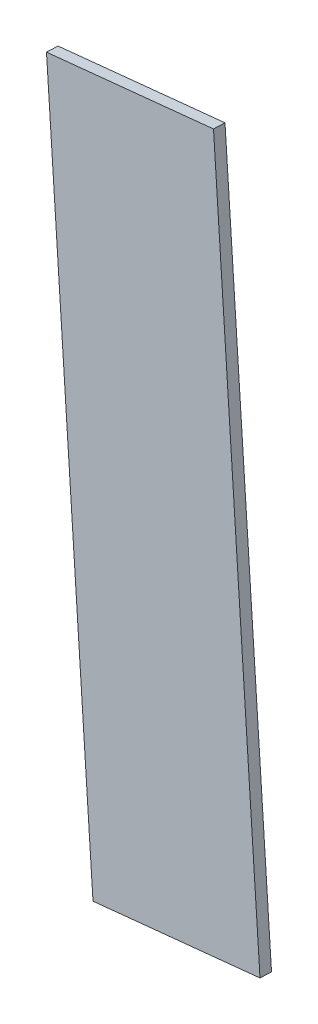
ISO-10303-21;
HEADER;
FILE_DESCRIPTION(('STEP AP214'),'2;1');
FILE_NAME('part.step','',(''),(''),'','','');
FILE_SCHEMA(('AUTOMOTIVE_DESIGN { 1 0 10303 214 1 1 1 1 }'));
ENDSEC;
DATA;
#1=APPLICATION_CONTEXT('core data for automotive mechanical design processes');
#2=APPLICATION_PROTOCOL_DEFINITION('international standard','automotive_design',2000,#1);
#3=PRODUCT_CONTEXT('',#1,'mechanical');
#4=PRODUCT('Part','Part','',(#3));
#5=PRODUCT_RELATED_PRODUCT_CATEGORY('part','',(#4));
#6=PRODUCT_DEFINITION_FORMATION('','',#4);
#7=PRODUCT_DEFINITION_CONTEXT('part definition',#1,'design');
#8=PRODUCT_DEFINITION('design','',#6,#7);
#9=PRODUCT_DEFINITION_SHAPE('','',#8);
#10=(LENGTH_UNIT() NAMED_UNIT(*) SI_UNIT(.MILLI.,.METRE.));
#11=(NAMED_UNIT(*) PLANE_ANGLE_UNIT() SI_UNIT($,.RADIAN.));
#12=(NAMED_UNIT(*) SI_UNIT($,.STERADIAN.) SOLID_ANGLE_UNIT());
#13=UNCERTAINTY_MEASURE_WITH_UNIT(LENGTH_MEASURE(1.E-05),#10,'distance_accuracy_value','');
#14=(GEOMETRIC_REPRESENTATION_CONTEXT(3) GLOBAL_UNCERTAINTY_ASSIGNED_CONTEXT((#13)) GLOBAL_UNIT_ASSIGNED_CONTEXT((#10,
#11,#12)) REPRESENTATION_CONTEXT('',''));
#15=CARTESIAN_POINT('',(0.,0.,0.));
#16=DIRECTION('',(0.,0.,1.));
#17=DIRECTION('',(1.,0.,0.));
#18=AXIS2_PLACEMENT_3D('',#15,#16,#17);
#19=CARTESIAN_POINT('',(169.775684710398,30.5538115247473,-81.6040090007778));
#20=DIRECTION('',(-0.003430323683801,0.0338418339450888,0.999421314138666));
#21=DIRECTION('',(0.,-0.999427194346115,0.0338420330573163));
#22=AXIS2_PLACEMENT_3D('',#19,#20,#21);
#23=PLANE('',#22);
#24=DIRECTION('',(0.994862248698096,0.101237868094184,-1.33833319145184E-05));
#25=VECTOR('',#24,1.);
#26=CARTESIAN_POINT('',(172.279864094323,5.94540843509553,-80.7621381851768));
#27=LINE('',#26,#25);
#28=CARTESIAN_POINT('',(172.279864094323,5.94540843509553,-80.7621381851768));
#29=VERTEX_POINT('',#28);
#30=CARTESIAN_POINT('',(178.249037586512,6.55283564366063,-80.7622184851682));
#31=VERTEX_POINT('',#30);
#32=EDGE_CURVE('E36',#29,#31,#27,.T.);
#33=ORIENTED_EDGE('',*,*,#32,.T.);
#34=DIRECTION('',(0.101179736087782,-0.994286490071638,0.0340152416752995));
#35=VECTOR('',#34,1.);
#36=CARTESIAN_POINT('',(175.744858202587,31.1612387333124,-81.6040893007693));
#37=LINE('',#36,#35);
#38=CARTESIAN_POINT('',(175.744858202587,31.1612387333124,-81.6040893007693));
#39=VERTEX_POINT('',#38);
#40=EDGE_CURVE('E73',#39,#31,#37,.T.);
#41=ORIENTED_EDGE('',*,*,#40,.F.);
#42=DIRECTION('',(0.994862248698096,0.101237868094184,-1.33833319145184E-05));
#43=VECTOR('',#42,1.);
#44=CARTESIAN_POINT('',(169.775684710398,30.5538115247473,-81.6040090007778));
#45=LINE('',#44,#43);
#46=CARTESIAN_POINT('',(169.775684710398,30.5538115247473,-81.6040090007778));
#47=VERTEX_POINT('',#46);
#48=EDGE_CURVE('E11',#47,#39,#45,.T.);
#49=ORIENTED_EDGE('',*,*,#48,.F.);
#50=DIRECTION('',(0.101179736087782,-0.994286490071638,0.0340152416752995));
#51=VECTOR('',#50,1.);
#52=CARTESIAN_POINT('',(169.775684710398,30.5538115247473,-81.6040090007778));
#53=LINE('',#52,#51);
#54=EDGE_CURVE('E75',#47,#29,#53,.T.);
#55=ORIENTED_EDGE('',*,*,#54,.T.);
#56=EDGE_LOOP('',(#33,#41,#49,#55));
#57=FACE_BOUND('',#56,.T.);
#58=ADVANCED_FACE('F33',(#57),#23,.T.);
#59=CARTESIAN_POINT('',(169.775684710398,30.5538115247473,-81.6040090007778));
#60=DIRECTION('',(0.101179736087782,-0.994286490071638,0.0340152416753016));
#61=DIRECTION('',(0.994862202673153,0.101238321263851,0.));
#62=AXIS2_PLACEMENT_3D('',#59,#60,#61);
#63=PLANE('',#62);
#64=ORIENTED_EDGE('',*,*,#48,.T.);
#65=DIRECTION('',(0.00343032368380121,-0.0338418339450908,-0.999421314138666));
#66=VECTOR('',#65,1.);
#67=CARTESIAN_POINT('',(175.744858202587,31.1612387333124,-81.6040893007693));
#68=LINE('',#67,#66);
#69=CARTESIAN_POINT('',(175.746264635297,31.1473635813949,-82.0138520395661));
#70=VERTEX_POINT('',#69);
#71=EDGE_CURVE('E87',#39,#70,#68,.T.);
#72=ORIENTED_EDGE('',*,*,#71,.T.);
#73=DIRECTION('',(0.994862248698096,0.101237868094184,-1.33833319145184E-05));
#74=VECTOR('',#73,1.);
#75=CARTESIAN_POINT('',(169.777091143109,30.5399363728298,-82.0137717395746));
#76=LINE('',#75,#74);
#77=CARTESIAN_POINT('',(169.777091143109,30.5399363728298,-82.0137717395746));
#78=VERTEX_POINT('',#77);
#79=EDGE_CURVE('E41',#78,#70,#76,.T.);
#80=ORIENTED_EDGE('',*,*,#79,.F.);
#81=DIRECTION('',(0.00343032368380121,-0.0338418339450908,-0.999421314138666));
#82=VECTOR('',#81,1.);
#83=CARTESIAN_POINT('',(169.775684710398,30.5538115247473,-81.6040090007778));
#84=LINE('',#83,#82);
#85=EDGE_CURVE('E54',#47,#78,#84,.T.);
#86=ORIENTED_EDGE('',*,*,#85,.F.);
#87=EDGE_LOOP('',(#64,#72,#80,#86));
#88=FACE_BOUND('',#87,.T.);
#89=ADVANCED_FACE('F106',(#88),#63,.F.);
#90=CARTESIAN_POINT('',(169.777091143109,30.5399363728298,-82.0137717395746));
#91=DIRECTION('',(-0.003430323683801,0.0338418339450887,0.999421314138666));
#92=DIRECTION('',(0.,-0.999427194346115,0.0338420330573162));
#93=AXIS2_PLACEMENT_3D('',#90,#91,#92);
#94=PLANE('',#93);
#95=ORIENTED_EDGE('',*,*,#79,.T.);
#96=DIRECTION('',(0.101179736087782,-0.994286490071638,0.0340152416752995));
#97=VECTOR('',#96,1.);
#98=CARTESIAN_POINT('',(175.746264635297,31.1473635813949,-82.0138520395661));
#99=LINE('',#98,#97);
#100=CARTESIAN_POINT('',(178.250444019222,6.53896049174314,-81.1719812239651));
#101=VERTEX_POINT('',#100);
#102=EDGE_CURVE('E91',#70,#101,#99,.T.);
#103=ORIENTED_EDGE('',*,*,#102,.T.);
#104=DIRECTION('',(0.994862248698096,0.101237868094184,-1.33833319145184E-05));
#105=VECTOR('',#104,1.);
#106=CARTESIAN_POINT('',(172.281270527034,5.93153328317804,-81.1719009239736));
#107=LINE('',#106,#105);
#108=CARTESIAN_POINT('',(172.281270527034,5.93153328317804,-81.1719009239736));
#109=VERTEX_POINT('',#108);
#110=EDGE_CURVE('E79',#109,#101,#107,.T.);
#111=ORIENTED_EDGE('',*,*,#110,.F.);
#112=DIRECTION('',(0.101179736087782,-0.994286490071638,0.0340152416752995));
#113=VECTOR('',#112,1.);
#114=CARTESIAN_POINT('',(169.777091143109,30.5399363728298,-82.0137717395746));
#115=LINE('',#114,#113);
#116=EDGE_CURVE('E99',#78,#109,#115,.T.);
#117=ORIENTED_EDGE('',*,*,#116,.F.);
#118=EDGE_LOOP('',(#95,#103,#111,#117));
#119=FACE_BOUND('',#118,.T.);
#120=ADVANCED_FACE('F104',(#119),#94,.F.);
#121=CARTESIAN_POINT('',(172.281270527034,5.93153328317804,-81.1719009239736));
#122=DIRECTION('',(-0.101179736087782,0.994286490071638,-0.0340152416753185));
#123=DIRECTION('',(-0.994862202673153,-0.101238321263851,0.));
#124=AXIS2_PLACEMENT_3D('',#121,#122,#123);
#125=PLANE('',#124);
#126=ORIENTED_EDGE('',*,*,#110,.T.);
#127=DIRECTION('',(-0.00343032368380293,0.0338418339451077,0.999421314138665));
#128=VECTOR('',#127,1.);
#129=CARTESIAN_POINT('',(178.250444019222,6.53896049174314,-81.1719812239651));
#130=LINE('',#129,#128);
#131=EDGE_CURVE('E84',#101,#31,#130,.T.);
#132=ORIENTED_EDGE('',*,*,#131,.T.);
#133=ORIENTED_EDGE('',*,*,#32,.F.);
#134=DIRECTION('',(-0.00343032368380293,0.0338418339451077,0.999421314138665));
#135=VECTOR('',#134,1.);
#136=CARTESIAN_POINT('',(172.281270527034,5.93153328317804,-81.1719009239736));
#137=LINE('',#136,#135);
#138=EDGE_CURVE('E97',#109,#29,#137,.T.);
#139=ORIENTED_EDGE('',*,*,#138,.F.);
#140=EDGE_LOOP('',(#126,#132,#133,#139));
#141=FACE_BOUND('',#140,.T.);
#142=ADVANCED_FACE('F89',(#141),#125,.F.);
#143=CARTESIAN_POINT('',(171.114032858927,17.4126819168237,-0.00230190249954673));
#144=DIRECTION('',(-0.994862248698096,-0.101237868094184,1.33833319145184E-05));
#145=DIRECTION('',(1.33145716847432E-05,1.35489999114403E-06,0.999999999910443));
#146=AXIS2_PLACEMENT_3D('',#143,#144,#145);
#147=PLANE('',#146);
#148=ORIENTED_EDGE('',*,*,#54,.F.);
#149=ORIENTED_EDGE('',*,*,#85,.T.);
#150=ORIENTED_EDGE('',*,*,#116,.T.);
#151=ORIENTED_EDGE('',*,*,#138,.T.);
#152=EDGE_LOOP('',(#148,#149,#150,#151));
#153=FACE_BOUND('',#152,.T.);
#154=ADVANCED_FACE('F107',(#153),#147,.T.);
#155=CARTESIAN_POINT('',(177.083206351116,18.0201091253888,-0.00238220249103384));
#156=DIRECTION('',(-0.994862248698096,-0.101237868094184,1.33833319145184E-05));
#157=DIRECTION('',(1.33145716847432E-05,1.35489999114403E-06,0.999999999910443));
#158=AXIS2_PLACEMENT_3D('',#155,#156,#157);
#159=PLANE('',#158);
#160=ORIENTED_EDGE('',*,*,#40,.T.);
#161=ORIENTED_EDGE('',*,*,#131,.F.);
#162=ORIENTED_EDGE('',*,*,#102,.F.);
#163=ORIENTED_EDGE('',*,*,#71,.F.);
#164=EDGE_LOOP('',(#160,#161,#162,#163));
#165=FACE_BOUND('',#164,.T.);
#166=ADVANCED_FACE('F82',(#165),#159,.F.);
#167=CLOSED_SHELL('',(#58,#89,#120,#142,#154,#166));
#168=MANIFOLD_SOLID_BREP('B2',#167);
#169=ADVANCED_BREP_SHAPE_REPRESENTATION('',(#18,#168),#14);
#170=SHAPE_DEFINITION_REPRESENTATION(#9,#169);
ENDSEC;
END-ISO-10303-21;
